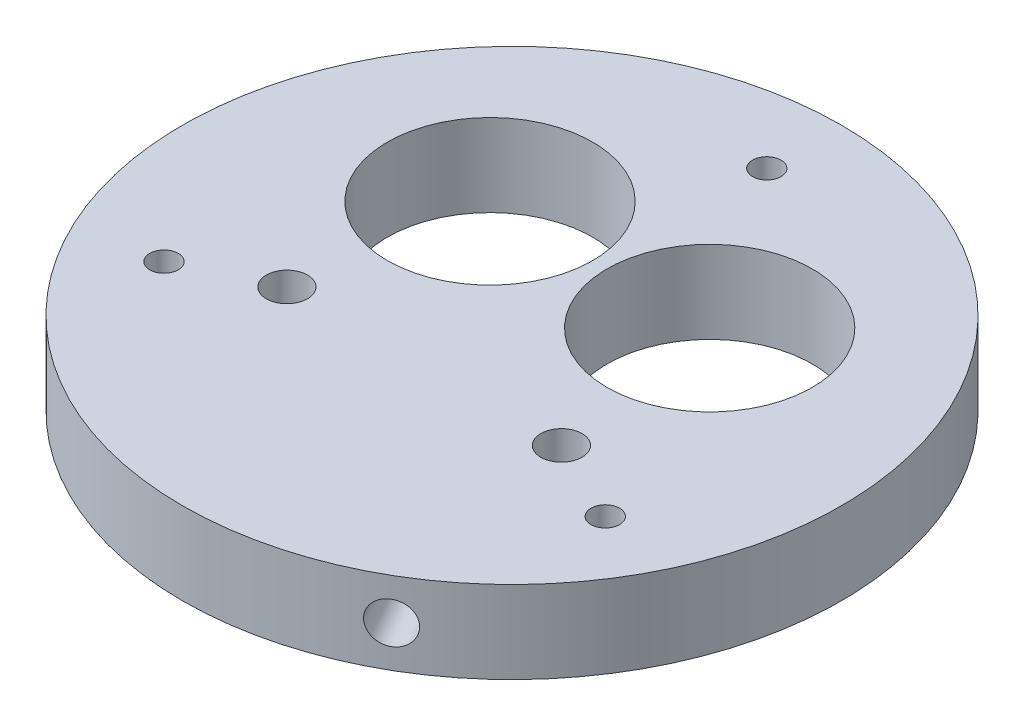
ISO-10303-21;
HEADER;
FILE_DESCRIPTION(('STEP AP214'),'2;1');
FILE_NAME('part.step','',(''),(''),'','','');
FILE_SCHEMA(('AUTOMOTIVE_DESIGN { 1 0 10303 214 1 1 1 1 }'));
ENDSEC;
DATA;
#1=APPLICATION_CONTEXT('core data for automotive mechanical design processes');
#2=APPLICATION_PROTOCOL_DEFINITION('international standard','automotive_design',2000,#1);
#3=PRODUCT_CONTEXT('',#1,'mechanical');
#4=PRODUCT('Part','Part','',(#3));
#5=PRODUCT_RELATED_PRODUCT_CATEGORY('part','',(#4));
#6=PRODUCT_DEFINITION_FORMATION('','',#4);
#7=PRODUCT_DEFINITION_CONTEXT('part definition',#1,'design');
#8=PRODUCT_DEFINITION('design','',#6,#7);
#9=PRODUCT_DEFINITION_SHAPE('','',#8);
#10=(LENGTH_UNIT() NAMED_UNIT(*) SI_UNIT(.MILLI.,.METRE.));
#11=(NAMED_UNIT(*) PLANE_ANGLE_UNIT() SI_UNIT($,.RADIAN.));
#12=(NAMED_UNIT(*) SI_UNIT($,.STERADIAN.) SOLID_ANGLE_UNIT());
#13=UNCERTAINTY_MEASURE_WITH_UNIT(LENGTH_MEASURE(1.E-05),#10,'distance_accuracy_value','');
#14=(GEOMETRIC_REPRESENTATION_CONTEXT(3) GLOBAL_UNCERTAINTY_ASSIGNED_CONTEXT((#13)) GLOBAL_UNIT_ASSIGNED_CONTEXT((#10,
#11,#12)) REPRESENTATION_CONTEXT('',''));
#15=CARTESIAN_POINT('',(0.,0.,0.));
#16=DIRECTION('',(0.,0.,1.));
#17=DIRECTION('',(1.,0.,0.));
#18=AXIS2_PLACEMENT_3D('',#15,#16,#17);
#19=CARTESIAN_POINT('',(0.,9.525,0.));
#20=DIRECTION('',(0.,-1.,0.));
#21=DIRECTION('',(0.,0.,-1.));
#22=AXIS2_PLACEMENT_3D('',#19,#20,#21);
#23=CYLINDRICAL_SURFACE('',#22,38.1127);
#24=CARTESIAN_POINT('',(21.0760412223567,4.7625,31.754974219538));
#25=CARTESIAN_POINT('',(21.0760366394158,4.62923983544651,31.7549780096859));
#26=CARTESIAN_POINT('',(21.0666489484644,4.49588634195096,31.7612141519004));
#27=CARTESIAN_POINT('',(21.0293051910214,4.23286151976421,31.7859514054377));
#28=CARTESIAN_POINT('',(21.0013275072642,4.10319466132266,31.8044667955651));
#29=CARTESIAN_POINT('',(20.9275236315503,3.8513911345155,31.8530782980891));
#30=CARTESIAN_POINT('',(20.8817068555677,3.72925053290825,31.8831683009792));
#31=CARTESIAN_POINT('',(20.7734079149441,3.49592055513315,31.9538352207014));
#32=CARTESIAN_POINT('',(20.71092956829,3.38472867805543,31.9944097349493));
#33=CARTESIAN_POINT('',(20.5708143365884,3.17625429793563,32.0846759739591));
#34=CARTESIAN_POINT('',(20.4931575769798,3.07899032452426,32.1343796472094));
#35=CARTESIAN_POINT('',(20.3247516945946,2.90129127689857,32.2411583146005));
#36=CARTESIAN_POINT('',(20.2340020261933,2.82085690437186,32.2982336159309));
#37=CARTESIAN_POINT('',(20.0417272733482,2.67904384677509,32.4178944707138));
#38=CARTESIAN_POINT('',(19.9401936531311,2.61768040994677,32.4804843823414));
#39=CARTESIAN_POINT('',(19.7291442714973,2.51584875804748,32.6091095154967));
#40=CARTESIAN_POINT('',(19.6196285951165,2.47538032041119,32.6751447003185));
#41=CARTESIAN_POINT('',(19.3957739636609,2.41653860293246,32.8085171428429));
#42=CARTESIAN_POINT('',(19.2814415211572,2.3981364214773,32.8758525797357));
#43=CARTESIAN_POINT('',(19.0510246293537,2.38386033661758,33.0099094935687));
#44=CARTESIAN_POINT('',(18.9349401997172,2.3879861805584,33.0766309773861));
#45=CARTESIAN_POINT('',(18.7044957288376,2.41862518184881,33.2074882983395));
#46=CARTESIAN_POINT('',(18.5901335171868,2.44510724809921,33.2716275968358));
#47=CARTESIAN_POINT('',(18.3662781855052,2.51965871909632,33.3957200271951));
#48=CARTESIAN_POINT('',(18.2567850941236,2.56772825084278,33.4556731344283));
#49=CARTESIAN_POINT('',(18.0458070050237,2.68412534410554,33.5699444462652));
#50=CARTESIAN_POINT('',(17.9443276399407,2.75246699667637,33.6242586957566));
#51=CARTESIAN_POINT('',(17.7524782531567,2.90745810824412,33.7259428941386));
#52=CARTESIAN_POINT('',(17.6621083557148,2.99410777198625,33.7733127653577));
#53=CARTESIAN_POINT('',(17.4950569531984,3.1834308388446,33.8601503479534));
#54=CARTESIAN_POINT('',(17.418398975997,3.28613122789602,33.8996044908121));
#55=CARTESIAN_POINT('',(17.2813078250731,3.50454590614921,33.9696960293586));
#56=CARTESIAN_POINT('',(17.2208746577659,3.62026020049682,34.0003334215601));
#57=CARTESIAN_POINT('',(17.118105997625,3.86143523082251,34.0521905045266));
#58=CARTESIAN_POINT('',(17.0757715187726,3.98689651241167,34.0734096676365));
#59=CARTESIAN_POINT('',(17.0105368371064,4.24399622181942,34.1060240925116));
#60=CARTESIAN_POINT('',(16.9876364070475,4.37563457738962,34.1174194691477));
#61=CARTESIAN_POINT('',(16.9620172373928,4.64111479483817,34.1301638035834));
#62=CARTESIAN_POINT('',(16.959264636518,4.77495258056907,34.1315296174955));
#63=CARTESIAN_POINT('',(16.9739389552718,5.04124074229214,34.1242342357314));
#64=CARTESIAN_POINT('',(16.9913657705372,5.17369112545607,34.1155730919124));
#65=CARTESIAN_POINT('',(17.0458248969068,5.4333379502686,34.0883949498703));
#66=CARTESIAN_POINT('',(17.0828416489487,5.56053847524434,34.0698857732615));
#67=CARTESIAN_POINT('',(17.1753097046026,5.80620085402902,34.0233640465242));
#68=CARTESIAN_POINT('',(17.2307611743943,5.9246626290508,33.9953514107267));
#69=CARTESIAN_POINT('',(17.3584648799842,6.14965822912002,33.9303215419672));
#70=CARTESIAN_POINT('',(17.4307394223592,6.2561759365946,33.893292350458));
#71=CARTESIAN_POINT('',(17.5898328601481,6.45409739440115,33.8109994055244));
#72=CARTESIAN_POINT('',(17.6766518971578,6.54550099757473,33.7657355719324));
#73=CARTESIAN_POINT('',(17.8623365203939,6.71072714043947,33.6678755384031));
#74=CARTESIAN_POINT('',(17.9612185613172,6.78452525054199,33.6152693085664));
#75=CARTESIAN_POINT('',(18.1679714369437,6.91227837888538,33.5039770760276));
#76=CARTESIAN_POINT('',(18.2758422164694,6.96623351892175,33.4452911106457));
#77=CARTESIAN_POINT('',(18.4973004702813,7.05272662376929,33.3233211418744));
#78=CARTESIAN_POINT('',(18.6108837528295,7.08528005291724,33.2600404952821));
#79=CARTESIAN_POINT('',(18.8405245180975,7.12809627337091,33.1304981656239));
#80=CARTESIAN_POINT('',(18.9565819766364,7.13835928242649,33.0642365116852));
#81=CARTESIAN_POINT('',(19.1876400791901,7.13630121823691,32.9306869973518));
#82=CARTESIAN_POINT('',(19.3026421805898,7.12401837921867,32.8634010658438));
#83=CARTESIAN_POINT('',(19.5285556890179,7.07729655177778,32.7296601309944));
#84=CARTESIAN_POINT('',(19.6394670888444,7.04285752435006,32.6632051291161));
#85=CARTESIAN_POINT('',(19.8541439104272,6.95280952372205,32.533162065675));
#86=CARTESIAN_POINT('',(19.9579093809251,6.89720069493608,32.4695739845583));
#87=CARTESIAN_POINT('',(20.1554972974021,6.76639697704172,32.3472927233238));
#88=CARTESIAN_POINT('',(20.2493200019863,6.69120259751732,32.2885994159045));
#89=CARTESIAN_POINT('',(20.4246877885775,6.5232211222031,32.177955443998));
#90=CARTESIAN_POINT('',(20.5062132374304,6.43040641723475,32.1260155795692));
#91=CARTESIAN_POINT('',(20.6547021706383,6.22985544097584,32.0307506103098));
#92=CARTESIAN_POINT('',(20.7216620859795,6.12211552310079,31.987427617106));
#93=CARTESIAN_POINT('',(20.8393385178461,5.89464993528759,31.9108887458249));
#94=CARTESIAN_POINT('',(20.8900348472884,5.77490960987748,31.8776854312735));
#95=CARTESIAN_POINT('',(20.9737224291797,5.52703554963833,31.8226868749198));
#96=CARTESIAN_POINT('',(21.0067344217382,5.39891184565561,31.8008782701975));
#97=CARTESIAN_POINT('',(21.0456383722794,5.18542007143344,31.7751367123279));
#98=CARTESIAN_POINT('',(21.0570260462234,5.10143206263123,31.7675878827828));
#99=CARTESIAN_POINT('',(21.0722289277564,4.93247536067763,31.757505430987));
#100=CARTESIAN_POINT('',(21.076044145815,4.84750666888227,31.7549718018024));
#101=CARTESIAN_POINT('',(21.0760412223567,4.7625,31.754974219538));
#102=B_SPLINE_CURVE_WITH_KNOTS('',3,(#24,#25,#26,#27,#28,#29,#30,#31,#32,#33,#34,#35,#36,#37,
#38,#39,#40,#41,#42,#43,#44,#45,#46,#47,#48,#49,#50,#51,#52,#53,#54,#55,#56,#57,#58,#59,#60,#61,
#62,#63,#64,#65,#66,#67,#68,#69,#70,#71,#72,#73,#74,#75,#76,#77,#78,#79,#80,#81,#82,#83,#84,#85,
#86,#87,#88,#89,#90,#91,#92,#93,#94,#95,#96,#97,#98,#99,#100,#101),.UNSPECIFIED.,.T.,.F.,(4,2,2,
2,2,2,2,2,2,2,2,2,2,2,2,2,2,2,2,2,2,2,2,2,2,2,2,2,2,2,2,2,2,2,2,2,2,2,4),(0.,0.399470166575744,
0.799405669569558,1.19913036091437,1.59876353422035,1.99892353439711,2.39910021538456,
2.79959604090947,3.20008760042221,3.60005403509276,4.0000159840989,4.3994226152202,
4.79883159609414,5.19851885742417,5.59821058884018,5.99858169444916,6.39895295837009,
6.7993466502068,7.19973566011932,7.59945160478513,7.99916548222124,8.3985623673094,
8.79796285285544,9.19789597157583,9.59783298401314,9.99832176716476,10.3988080920882,
10.7990047167025,11.1991974318728,11.5987121097933,11.9982274910451,12.3977401469663,
12.7972424092598,13.1973758943832,13.597607314624,13.9983336147515,14.3985889102477,
14.653411311538,14.9082333605144),.UNSPECIFIED.);
#103=CARTESIAN_POINT('',(21.0760412223567,4.7625,31.754974219538));
#104=VERTEX_POINT('',#103);
#105=EDGE_CURVE('E91',#104,#104,#102,.T.);
#106=ORIENTED_EDGE('',*,*,#105,.T.);
#107=EDGE_LOOP('',(#106));
#108=FACE_BOUND('',#107,.T.);
#109=CARTESIAN_POINT('',(-38.0386349818182,4.7625,2.37489999999974));
#110=CARTESIAN_POINT('',(-38.0386359727121,4.62923983544651,2.37489413598259));
#111=CARTESIAN_POINT('',(-38.0393427848158,4.49588634195096,2.36364608602858));
#112=CARTESIAN_POINT('',(-38.0420939960774,4.23286151976421,2.31893681664145));
#113=CARTESIAN_POINT('',(-38.0441399524101,4.10319466132266,2.28544973670502));
#114=CARTESIAN_POINT('',(-38.0493368106551,3.8513911345155,2.19722795417699));
#115=CARTESIAN_POINT('',(-38.0524871295666,3.72925053290825,2.14250446081157));
#116=CARTESIAN_POINT('',(-38.0595370069414,3.49592055513315,2.01338136716741));
#117=CARTESIAN_POINT('',(-38.0634363936992,3.38472867805543,1.93898627465461));
#118=CARTESIAN_POINT('',(-38.071551633935,3.17625429793563,1.772509805039));
#119=CARTESIAN_POINT('',(-38.0757678978269,3.07899032452426,1.68040524181714));
#120=CARTESIAN_POINT('',(-38.0840379951772,2.90129127689857,1.48117213582934));
#121=CARTESIAN_POINT('',(-38.0880918218573,2.82085690437186,1.37404296694357));
#122=CARTESIAN_POINT('',(-38.0955837855154,2.67904384677508,1.14769771908191));
#123=CARTESIAN_POINT('',(-38.0990214288969,2.61768040994676,1.02847206882181));
#124=CARTESIAN_POINT('',(-38.1048893709577,2.51584875804748,0.781385376296295));
#125=CARTESIAN_POINT('',(-38.1073196803666,2.47538032041119,0.6535244260271));
#126=CARTESIAN_POINT('',(-38.1108962880296,2.41653860293246,0.392974407169469));
#127=CARTESIAN_POINT('',(-38.1120442657019,2.3981364214773,0.260291889038118));
#128=CARTESIAN_POINT('',(-38.1129325127325,2.38386033661758,-0.00628344964126589));
#129=CARTESIAN_POINT('',(-38.1126727978782,2.3879861805584,-0.140176256598945));
#130=CARTESIAN_POINT('',(-38.1107763266553,2.41862518184881,-0.405175683018997));
#131=CARTESIAN_POINT('',(-38.1091414827086,2.44510724809921,-0.536285912789689));
#132=CARTESIAN_POINT('',(-38.1046810139763,2.51965871909632,-0.792196531978296));
#133=CARTESIAN_POINT('',(-38.1018553821853,2.56772825084278,-0.916996884270195));
#134=CARTESIAN_POINT('',(-38.0953281966098,2.68412534410554,-1.15684492499112));
#135=CARTESIAN_POINT('',(-38.0916260339154,2.75246699667637,-1.2718857578586));
#136=CARTESIAN_POINT('',(-38.0837624394857,2.90745810824412,-1.48887429970503));
#137=CARTESIAN_POINT('',(-38.0796010026144,2.99410777198625,-1.59082186223663));
#138=CARTESIAN_POINT('',(-38.0712788538873,3.1834308388446,-1.77891141185151));
#139=CARTESIAN_POINT('',(-38.0671181552869,3.28613122789602,-1.86502623893997));
#140=CARTESIAN_POINT('',(-38.0592736327965,3.50454590614921,-2.01879642754742));
#141=CARTESIAN_POINT('',(-38.0555898090951,3.62026020049682,-2.08645178176728));
#142=CARTESIAN_POINT('',(-38.0491150302397,3.86143523082251,-2.20138059364549));
#143=CARTESIAN_POINT('',(-38.0463241251138,3.98689651241167,-2.24865290934261));
#144=CARTESIAN_POINT('',(-38.0419517047523,4.24399622181942,-2.32145501331087));
#145=CARTESIAN_POINT('',(-38.0403701753754,4.37563457738962,-2.34698505581749));
#146=CARTESIAN_POINT('',(-38.0385975079237,4.64111479483817,-2.3755440747802));
#147=CARTESIAN_POINT('',(-38.038404037031,4.77495258056907,-2.37861080402032));
#148=CARTESIAN_POINT('',(-38.03942321047,5.04124074229214,-2.3622547803142));
#149=CARTESIAN_POINT('',(-38.0406358475295,5.17369112545607,-2.34283214367779));
#150=CARTESIAN_POINT('',(-38.0443284492782,5.4333379502686,-2.28208008575283));
#151=CARTESIAN_POINT('',(-38.0468074081529,5.56053847524434,-2.24076804981454));
#152=CARTESIAN_POINT('',(-38.0527524387974,5.80620085402902,-2.137427501211));
#153=CARTESIAN_POINT('',(-38.0562185194656,5.9246626290508,-2.07539880179551));
#154=CARTESIAN_POINT('',(-38.06375285391,6.14965822912002,-1.93228921421749));
#155=CARTESIAN_POINT('',(-38.067821904569,6.25617593659461,-1.85118302871922));
#156=CARTESIAN_POINT('',(-38.0761008425987,6.45409739440115,-1.6722575975518));
#157=CARTESIAN_POINT('',(-38.0803107313402,6.54550099757473,-1.57443818917331));
#158=CARTESIAN_POINT('',(-38.0884037679067,6.71072714043947,-1.36470057159411));
#159=CARTESIAN_POINT('',(-38.0922864569324,6.78452525054199,-1.25276309725812));
#160=CARTESIAN_POINT('',(-38.0992809941233,6.91227837888538,-1.01806373839066));
#161=CARTESIAN_POINT('',(-38.1023928470198,6.96623351892175,-0.895301920304402));
#162=CARTESIAN_POINT('',(-38.107492882471,7.05272662376929,-0.642528462239899));
#163=CARTESIAN_POINT('',(-38.1094818762282,7.08528005291724,-0.51252213081175));
#164=CARTESIAN_POINT('',(-38.1121153105128,7.12809627337091,-0.248876229516099));
#165=CARTESIAN_POINT('',(-38.1127597641746,7.13835928242649,-0.115236695153412));
#166=CARTESIAN_POINT('',(-38.1126315433756,7.13630121823691,0.15164024857506));
#167=CARTESIAN_POINT('',(-38.1118612680722,7.12401837921867,0.284877955629739));
#168=CARTESIAN_POINT('',(-38.1089949751808,7.07729655177778,0.547395260411217));
#169=CARTESIAN_POINT('',(-38.1068989552589,7.04285752435006,0.676674851169493));
#170=CARTESIAN_POINT('',(-38.1016167695243,6.95280952372205,0.92761196398437));
#171=CARTESIAN_POINT('',(-38.0984306111483,6.89720069493608,1.04926953802959));
#172=CARTESIAN_POINT('',(-38.091325890751,6.76639697704172,1.28152632379673));
#173=CARTESIAN_POINT('',(-38.0874073477859,6.69120259751732,1.39212582312806));
#174=CARTESIAN_POINT('',(-38.0792707506348,6.5232211222031,1.59932076727469));
#175=CARTESIAN_POINT('',(-38.0750522329968,6.43040641723475,1.69589380925072));
#176=CARTESIAN_POINT('',(-38.0667948161314,6.22985544097584,1.87212148221924));
#177=CARTESIAN_POINT('',(-38.0627559611195,6.12211552310079,1.95177196654192));
#178=CARTESIAN_POINT('',(-38.0553095701463,5.89464993528759,2.09195218160562));
#179=CARTESIAN_POINT('',(-38.0519028209761,5.77490960987748,2.152458148057));
#180=CARTESIAN_POINT('',(-38.046116464948,5.52703554963833,2.252432998133));
#181=CARTESIAN_POINT('',(-38.0437356555167,5.39891184565561,2.29192652467931));
#182=CARTESIAN_POINT('',(-38.0408947877392,5.18542007143344,2.33848911309042));
#183=CARTESIAN_POINT('',(-38.0400511465564,5.10143206263123,2.35212554278849));
#184=CARTESIAN_POINT('',(-38.0389209279353,4.93247536067763,2.37033285030469));
#185=CARTESIAN_POINT('',(-38.0386343497268,4.84750666888227,2.37490374065671));
#186=CARTESIAN_POINT('',(-38.0386349818182,4.7625,2.37489999999974));
#187=B_SPLINE_CURVE_WITH_KNOTS('',3,(#109,#110,#111,#112,#113,#114,#115,#116,#117,#118,#119,
#120,#121,#122,#123,#124,#125,#126,#127,#128,#129,#130,#131,#132,#133,#134,#135,#136,#137,#138,
#139,#140,#141,#142,#143,#144,#145,#146,#147,#148,#149,#150,#151,#152,#153,#154,#155,#156,#157,
#158,#159,#160,#161,#162,#163,#164,#165,#166,#167,#168,#169,#170,#171,#172,#173,#174,#175,#176,
#177,#178,#179,#180,#181,#182,#183,#184,#185,#186),.UNSPECIFIED.,.T.,.F.,(4,2,2,2,2,2,2,2,2,2,2,
2,2,2,2,2,2,2,2,2,2,2,2,2,2,2,2,2,2,2,2,2,2,2,2,2,2,2,4),(0.,0.399470166575745,
0.799405669569559,1.19913036091437,1.59876353422035,1.99892353439712,2.39910021538456,
2.79959604090948,3.20008760042221,3.60005403509275,4.0000159840989,4.3994226152202,
4.79883159609414,5.19851885742417,5.59821058884018,5.99858169444916,6.39895295837009,
6.7993466502068,7.19973566011932,7.59945160478513,7.99916548222124,8.39856236730939,
8.79796285285544,9.19789597157583,9.59783298401314,9.99832176716475,10.3988080920882,
10.7990047167025,11.1991974318728,11.5987121097933,11.9982274910452,12.3977401469663,
12.7972424092598,13.1973758943832,13.597607314624,13.9983336147515,14.3985889102477,
14.653411311538,14.9082333605144),.UNSPECIFIED.);
#188=CARTESIAN_POINT('',(-38.0386349818182,4.7625,2.37489999999974));
#189=VERTEX_POINT('',#188);
#190=EDGE_CURVE('E92',#189,#189,#187,.T.);
#191=ORIENTED_EDGE('',*,*,#190,.T.);
#192=EDGE_LOOP('',(#191));
#193=FACE_BOUND('',#192,.T.);
#194=CARTESIAN_POINT('',(16.9625937594613,4.7625,-34.129874219538));
#195=CARTESIAN_POINT('',(16.9625993332961,4.62923983544651,-34.1298721456687));
#196=CARTESIAN_POINT('',(16.9726938363512,4.49588634195096,-34.1248602379292));
#197=CARTESIAN_POINT('',(17.0127888050559,4.23286151976421,-34.1048882220794));
#198=CARTESIAN_POINT('',(17.0428124451457,4.10319466132266,-34.0899165322703));
#199=CARTESIAN_POINT('',(17.1218131791047,3.8513911345155,-34.0503062522664));
#200=CARTESIAN_POINT('',(17.1707802739987,3.72925053290825,-34.025672761791));
#201=CARTESIAN_POINT('',(17.2861290919972,3.49592055513315,-33.9672165878691));
#202=CARTESIAN_POINT('',(17.3525068254091,3.38472867805543,-33.9333960096041));
#203=CARTESIAN_POINT('',(17.5007372973464,3.17625429793563,-33.8571857789983));
#204=CARTESIAN_POINT('',(17.582610320847,3.07899032452425,-33.8147848890268));
#205=CARTESIAN_POINT('',(17.7592863005824,2.90129127689856,-33.7223304504301));
#206=CARTESIAN_POINT('',(17.8540897956639,2.82085690437185,-33.6722765828747));
#207=CARTESIAN_POINT('',(18.053856512167,2.67904384677508,-33.565592189796));
#208=CARTESIAN_POINT('',(18.1588277757657,2.61768040994676,-33.5089564511635));
#209=CARTESIAN_POINT('',(18.3757450994603,2.51584875804748,-33.3904948917933));
#210=CARTESIAN_POINT('',(18.4876910852499,2.47538032041119,-33.3286691263459));
#211=CARTESIAN_POINT('',(18.7151223243686,2.41653860293246,-33.2014915500126));
#212=CARTESIAN_POINT('',(18.8306027445446,2.3981364214773,-33.1361444687741));
#213=CARTESIAN_POINT('',(19.0619078833787,2.38386033661758,-33.0036260439278));
#214=CARTESIAN_POINT('',(19.1777325981609,2.3879861805584,-32.9364547207874));
#215=CARTESIAN_POINT('',(19.4062805978175,2.41862518184881,-32.8023126153207));
#216=CARTESIAN_POINT('',(19.5190079655216,2.44510724809921,-32.7353416840463));
#217=CARTESIAN_POINT('',(19.738402828471,2.51965871909632,-32.6035234952171));
#218=CARTESIAN_POINT('',(19.8450702880615,2.56772825084278,-32.5386762501584));
#219=CARTESIAN_POINT('',(20.049521191586,2.68412534410554,-32.4130995212744));
#220=CARTESIAN_POINT('',(20.1472983939746,2.75246699667637,-32.3523729378983));
#221=CARTESIAN_POINT('',(20.3312841863289,2.90745810824412,-32.2370685944339));
#222=CARTESIAN_POINT('',(20.4174926468995,2.99410777198625,-32.1824909031213));
#223=CARTESIAN_POINT('',(20.5762219006888,3.1834308388446,-32.0812389361022));
#224=CARTESIAN_POINT('',(20.6487191792897,3.28613122789603,-32.0345782518724));
#225=CARTESIAN_POINT('',(20.7779658077233,3.50454590614921,-31.9508996018115));
#226=CARTESIAN_POINT('',(20.834715151329,3.62026020049682,-31.9138816397931));
#227=CARTESIAN_POINT('',(20.9310090326146,3.86143523082251,-31.8508099108814));
#228=CARTESIAN_POINT('',(20.9705526063411,3.98689651241167,-31.8247567582942));
#229=CARTESIAN_POINT('',(21.0314148676458,4.24399622181942,-31.784569079201));
#230=CARTESIAN_POINT('',(21.0527337683278,4.37563457738962,-31.7704344133304));
#231=CARTESIAN_POINT('',(21.0765802705308,4.64111479483817,-31.7546197288035));
#232=CARTESIAN_POINT('',(21.079139400513,4.77495258056907,-31.7529188134755));
#233=CARTESIAN_POINT('',(21.065484255198,5.04124074229214,-31.7619794554175));
#234=CARTESIAN_POINT('',(21.0492700769922,5.17369112545607,-31.7727409482349));
#235=CARTESIAN_POINT('',(20.9985035523713,5.4333379502686,-31.8063148641178));
#236=CARTESIAN_POINT('',(20.963965759204,5.56053847524434,-31.8291177234473));
#237=CARTESIAN_POINT('',(20.8774427341946,5.80620085402902,-31.8859365453135));
#238=CARTESIAN_POINT('',(20.8254573450712,5.9246626290508,-31.9199526089315));
#239=CARTESIAN_POINT('',(20.7052879739257,6.14965822912002,-31.99803232775));
#240=CARTESIAN_POINT('',(20.6370824822097,6.2561759365946,-32.0421093217391));
#241=CARTESIAN_POINT('',(20.4862679824505,6.45409739440115,-32.1387418079729));
#242=CARTESIAN_POINT('',(20.4036588341823,6.54550099757473,-32.1912973827593));
#243=CARTESIAN_POINT('',(20.2260672475127,6.71072714043947,-32.3031749668093));
#244=CARTESIAN_POINT('',(20.1310678956151,6.78452525054199,-32.3625062113085));
#245=CARTESIAN_POINT('',(19.9313095571794,6.91227837888538,-32.4859133376372));
#246=CARTESIAN_POINT('',(19.8265506305502,6.96623351892175,-32.5499891903416));
#247=CARTESIAN_POINT('',(19.6101924121895,7.05272662376929,-32.6807926796348));
#248=CARTESIAN_POINT('',(19.4985981233985,7.08528005291724,-32.7475183644706));
#249=CARTESIAN_POINT('',(19.2715907924151,7.12809627337091,-32.881621936108));
#250=CARTESIAN_POINT('',(19.156177787538,7.13835928242649,-32.9489998165321));
#251=CARTESIAN_POINT('',(18.9249914641853,7.13630121823691,-33.0823272459271));
#252=CARTESIAN_POINT('',(18.8092190874823,7.12401837921867,-33.1482790214738));
#253=CARTESIAN_POINT('',(18.5804392861628,7.07729655177778,-33.2770553914059));
#254=CARTESIAN_POINT('',(18.4674318664143,7.04285752435006,-33.3398799802858));
#255=CARTESIAN_POINT('',(18.247472859097,6.95280952372205,-33.4607740296596));
#256=CARTESIAN_POINT('',(18.1405212302231,6.89720069493608,-33.5188435225881));
#257=CARTESIAN_POINT('',(17.9358285933487,6.76639697704173,-33.6288190471208));
#258=CARTESIAN_POINT('',(17.8380873457994,6.69120259751732,-33.6807252390329));
#259=CARTESIAN_POINT('',(17.6545829620572,6.5232211222031,-33.777276211273));
#260=CARTESIAN_POINT('',(17.5688389955662,6.43040641723475,-33.8219093888201));
#261=CARTESIAN_POINT('',(17.4120926454929,6.22985544097584,-33.9028720925293));
#262=CARTESIAN_POINT('',(17.3410938751398,6.12211552310079,-33.9391995836482));
#263=CARTESIAN_POINT('',(17.2159710523001,5.89464993528759,-34.0028409274307));
#264=CARTESIAN_POINT('',(17.1618679736876,5.77490960987748,-34.0301435793307));
#265=CARTESIAN_POINT('',(17.0723940357682,5.52703554963833,-34.075119873053));
#266=CARTESIAN_POINT('',(17.0370012337784,5.39891184565561,-34.0928047948771));
#267=CARTESIAN_POINT('',(16.9952564154596,5.18542007143344,-34.1136258254185));
#268=CARTESIAN_POINT('',(16.9830251003328,5.10143206263123,-34.1197134255716));
#269=CARTESIAN_POINT('',(16.9666920001787,4.93247536067763,-34.127838281292));
#270=CARTESIAN_POINT('',(16.9625902039117,4.84750666888227,-34.1298755424593));
#271=CARTESIAN_POINT('',(16.9625937594613,4.7625,-34.129874219538));
#272=B_SPLINE_CURVE_WITH_KNOTS('',3,(#194,#195,#196,#197,#198,#199,#200,#201,#202,#203,#204,
#205,#206,#207,#208,#209,#210,#211,#212,#213,#214,#215,#216,#217,#218,#219,#220,#221,#222,#223,
#224,#225,#226,#227,#228,#229,#230,#231,#232,#233,#234,#235,#236,#237,#238,#239,#240,#241,#242,
#243,#244,#245,#246,#247,#248,#249,#250,#251,#252,#253,#254,#255,#256,#257,#258,#259,#260,#261,
#262,#263,#264,#265,#266,#267,#268,#269,#270,#271),.UNSPECIFIED.,.T.,.F.,(4,2,2,2,2,2,2,2,2,2,2,
2,2,2,2,2,2,2,2,2,2,2,2,2,2,2,2,2,2,2,2,2,2,2,2,2,2,2,4),(0.,0.399470166575744,0.79940566956956,
1.19913036091437,1.59876353422035,1.99892353439712,2.39910021538456,2.79959604090948,
3.20008760042221,3.60005403509275,4.0000159840989,4.39942261522021,4.79883159609414,
5.19851885742417,5.59821058884018,5.99858169444916,6.39895295837009,6.7993466502068,
7.19973566011932,7.59945160478513,7.99916548222124,8.39856236730939,8.79796285285544,
9.19789597157583,9.59783298401314,9.99832176716475,10.3988080920882,10.7990047167025,
11.1991974318728,11.5987121097933,11.9982274910451,12.3977401469663,12.7972424092598,
13.1973758943832,13.597607314624,13.9983336147515,14.3985889102477,14.653411311538,
14.9082333605144),.UNSPECIFIED.);
#273=CARTESIAN_POINT('',(16.9625937594613,4.7625,-34.129874219538));
#274=VERTEX_POINT('',#273);
#275=EDGE_CURVE('E10',#274,#274,#272,.T.);
#276=ORIENTED_EDGE('',*,*,#275,.T.);
#277=EDGE_LOOP('',(#276));
#278=FACE_BOUND('',#277,.T.);
#279=CARTESIAN_POINT('',(0.,9.525,0.));
#280=DIRECTION('',(0.,1.,0.));
#281=DIRECTION('',(0.,0.,1.));
#282=AXIS2_PLACEMENT_3D('',#279,#280,#281);
#283=CIRCLE('',#282,38.1127);
#284=CARTESIAN_POINT('',(0.,9.525,38.1127));
#285=VERTEX_POINT('',#284);
#286=EDGE_CURVE('E44',#285,#285,#283,.T.);
#287=ORIENTED_EDGE('',*,*,#286,.F.);
#288=EDGE_LOOP('',(#287));
#289=FACE_BOUND('',#288,.T.);
#290=CARTESIAN_POINT('',(0.,0.,0.));
#291=DIRECTION('',(0.,1.,0.));
#292=DIRECTION('',(0.,0.,1.));
#293=AXIS2_PLACEMENT_3D('',#290,#291,#292);
#294=CIRCLE('',#293,38.1127);
#295=CARTESIAN_POINT('',(0.,0.,38.1127));
#296=VERTEX_POINT('',#295);
#297=EDGE_CURVE('E48',#296,#296,#294,.T.);
#298=ORIENTED_EDGE('',*,*,#297,.T.);
#299=EDGE_LOOP('',(#298));
#300=FACE_BOUND('',#299,.T.);
#301=ADVANCED_FACE('F33',(#108,#193,#278,#289,#300),#23,.T.);
#302=CARTESIAN_POINT('',(0.,9.525,0.));
#303=DIRECTION('',(0.,1.,0.));
#304=DIRECTION('',(0.,0.,1.));
#305=AXIS2_PLACEMENT_3D('',#302,#303,#304);
#306=PLANE('',#305);
#307=CARTESIAN_POINT('',(-15.875,9.525,10.16));
#308=DIRECTION('',(0.,1.,0.));
#309=DIRECTION('',(0.,0.,1.));
#310=AXIS2_PLACEMENT_3D('',#307,#308,#309);
#311=CIRCLE('',#310,2.38125);
#312=CARTESIAN_POINT('',(-15.875,9.525,12.54125));
#313=VERTEX_POINT('',#312);
#314=EDGE_CURVE('E130',#313,#313,#311,.T.);
#315=ORIENTED_EDGE('',*,*,#314,.F.);
#316=EDGE_LOOP('',(#315));
#317=FACE_BOUND('',#316,.T.);
#318=CARTESIAN_POINT('',(15.875,9.525,10.16));
#319=DIRECTION('',(0.,1.,0.));
#320=DIRECTION('',(0.,0.,1.));
#321=AXIS2_PLACEMENT_3D('',#318,#319,#320);
#322=CIRCLE('',#321,2.38125);
#323=CARTESIAN_POINT('',(15.875,9.525,12.54125));
#324=VERTEX_POINT('',#323);
#325=EDGE_CURVE('E124',#324,#324,#322,.T.);
#326=ORIENTED_EDGE('',*,*,#325,.F.);
#327=EDGE_LOOP('',(#326));
#328=FACE_BOUND('',#327,.T.);
#329=CARTESIAN_POINT('',(0.,9.525,-29.464));
#330=DIRECTION('',(0.,1.,0.));
#331=DIRECTION('',(0.,0.,1.));
#332=AXIS2_PLACEMENT_3D('',#329,#330,#331);
#333=CIRCLE('',#332,1.651);
#334=CARTESIAN_POINT('',(0.,9.525,-27.813));
#335=VERTEX_POINT('',#334);
#336=EDGE_CURVE('E80',#335,#335,#333,.T.);
#337=ORIENTED_EDGE('',*,*,#336,.F.);
#338=EDGE_LOOP('',(#337));
#339=FACE_BOUND('',#338,.T.);
#340=CARTESIAN_POINT('',(-25.5165724971028,9.525,14.7320000000011));
#341=DIRECTION('',(0.,1.,0.));
#342=DIRECTION('',(0.,0.,1.));
#343=AXIS2_PLACEMENT_3D('',#340,#341,#342);
#344=CIRCLE('',#343,1.651);
#345=CARTESIAN_POINT('',(-25.5165724971028,9.525,16.3830000000011));
#346=VERTEX_POINT('',#345);
#347=EDGE_CURVE('E74',#346,#346,#344,.T.);
#348=ORIENTED_EDGE('',*,*,#347,.F.);
#349=EDGE_LOOP('',(#348));
#350=FACE_BOUND('',#349,.T.);
#351=CARTESIAN_POINT('',(-12.7,9.525,-10.16));
#352=DIRECTION('',(0.,1.,0.));
#353=DIRECTION('',(0.,0.,1.));
#354=AXIS2_PLACEMENT_3D('',#351,#352,#353);
#355=CIRCLE('',#354,11.8745);
#356=CARTESIAN_POINT('',(-12.7,9.525,1.7145));
#357=VERTEX_POINT('',#356);
#358=EDGE_CURVE('E68',#357,#357,#355,.T.);
#359=ORIENTED_EDGE('',*,*,#358,.F.);
#360=EDGE_LOOP('',(#359));
#361=FACE_BOUND('',#360,.T.);
#362=CARTESIAN_POINT('',(12.7,9.525,-10.16));
#363=DIRECTION('',(0.,1.,0.));
#364=DIRECTION('',(0.,0.,1.));
#365=AXIS2_PLACEMENT_3D('',#362,#363,#364);
#366=CIRCLE('',#365,11.8745);
#367=CARTESIAN_POINT('',(12.7,9.525,1.7145));
#368=VERTEX_POINT('',#367);
#369=EDGE_CURVE('E62',#368,#368,#366,.T.);
#370=ORIENTED_EDGE('',*,*,#369,.F.);
#371=EDGE_LOOP('',(#370));
#372=FACE_BOUND('',#371,.T.);
#373=CARTESIAN_POINT('',(25.5165724971066,9.525,14.7319999999989));
#374=DIRECTION('',(0.,1.,0.));
#375=DIRECTION('',(0.,0.,1.));
#376=AXIS2_PLACEMENT_3D('',#373,#374,#375);
#377=CIRCLE('',#376,1.651);
#378=CARTESIAN_POINT('',(25.5165724971066,9.525,16.3829999999989));
#379=VERTEX_POINT('',#378);
#380=EDGE_CURVE('E55',#379,#379,#377,.T.);
#381=ORIENTED_EDGE('',*,*,#380,.F.);
#382=EDGE_LOOP('',(#381));
#383=FACE_BOUND('',#382,.T.);
#384=ORIENTED_EDGE('',*,*,#286,.T.);
#385=EDGE_LOOP('',(#384));
#386=FACE_BOUND('',#385,.T.);
#387=ADVANCED_FACE('F146',(#317,#328,#339,#350,#361,#372,#383,#386),#306,.T.);
#388=CARTESIAN_POINT('',(0.,0.,0.));
#389=DIRECTION('',(0.,1.,0.));
#390=DIRECTION('',(0.,0.,1.));
#391=AXIS2_PLACEMENT_3D('',#388,#389,#390);
#392=PLANE('',#391);
#393=CARTESIAN_POINT('',(-15.875,0.,10.16));
#394=DIRECTION('',(0.,1.,0.));
#395=DIRECTION('',(0.,0.,1.));
#396=AXIS2_PLACEMENT_3D('',#393,#394,#395);
#397=CIRCLE('',#396,2.38125);
#398=CARTESIAN_POINT('',(-15.875,0.,12.54125));
#399=VERTEX_POINT('',#398);
#400=EDGE_CURVE('E100',#399,#399,#397,.T.);
#401=ORIENTED_EDGE('',*,*,#400,.T.);
#402=EDGE_LOOP('',(#401));
#403=FACE_BOUND('',#402,.T.);
#404=CARTESIAN_POINT('',(15.875,0.,10.16));
#405=DIRECTION('',(0.,1.,0.));
#406=DIRECTION('',(0.,0.,1.));
#407=AXIS2_PLACEMENT_3D('',#404,#405,#406);
#408=CIRCLE('',#407,2.38125);
#409=CARTESIAN_POINT('',(15.875,0.,12.54125));
#410=VERTEX_POINT('',#409);
#411=EDGE_CURVE('E127',#410,#410,#408,.T.);
#412=ORIENTED_EDGE('',*,*,#411,.T.);
#413=EDGE_LOOP('',(#412));
#414=FACE_BOUND('',#413,.T.);
#415=CARTESIAN_POINT('',(0.,0.,-29.464));
#416=DIRECTION('',(0.,1.,0.));
#417=DIRECTION('',(0.,0.,1.));
#418=AXIS2_PLACEMENT_3D('',#415,#416,#417);
#419=CIRCLE('',#418,1.651);
#420=CARTESIAN_POINT('',(0.,0.,-27.813));
#421=VERTEX_POINT('',#420);
#422=EDGE_CURVE('E53',#421,#421,#419,.T.);
#423=ORIENTED_EDGE('',*,*,#422,.T.);
#424=EDGE_LOOP('',(#423));
#425=FACE_BOUND('',#424,.T.);
#426=CARTESIAN_POINT('',(-25.5165724971028,0.,14.7320000000011));
#427=DIRECTION('',(0.,1.,0.));
#428=DIRECTION('',(0.,0.,1.));
#429=AXIS2_PLACEMENT_3D('',#426,#427,#428);
#430=CIRCLE('',#429,1.651);
#431=CARTESIAN_POINT('',(-25.5165724971028,0.,16.3830000000011));
#432=VERTEX_POINT('',#431);
#433=EDGE_CURVE('E77',#432,#432,#430,.T.);
#434=ORIENTED_EDGE('',*,*,#433,.T.);
#435=EDGE_LOOP('',(#434));
#436=FACE_BOUND('',#435,.T.);
#437=CARTESIAN_POINT('',(-12.7,0.,-10.16));
#438=DIRECTION('',(0.,1.,0.));
#439=DIRECTION('',(0.,0.,1.));
#440=AXIS2_PLACEMENT_3D('',#437,#438,#439);
#441=CIRCLE('',#440,11.8745);
#442=CARTESIAN_POINT('',(-12.7,0.,1.7145));
#443=VERTEX_POINT('',#442);
#444=EDGE_CURVE('E71',#443,#443,#441,.T.);
#445=ORIENTED_EDGE('',*,*,#444,.T.);
#446=EDGE_LOOP('',(#445));
#447=FACE_BOUND('',#446,.T.);
#448=CARTESIAN_POINT('',(12.7,0.,-10.16));
#449=DIRECTION('',(0.,1.,0.));
#450=DIRECTION('',(0.,0.,1.));
#451=AXIS2_PLACEMENT_3D('',#448,#449,#450);
#452=CIRCLE('',#451,11.8745);
#453=CARTESIAN_POINT('',(12.7,0.,1.7145));
#454=VERTEX_POINT('',#453);
#455=EDGE_CURVE('E65',#454,#454,#452,.T.);
#456=ORIENTED_EDGE('',*,*,#455,.T.);
#457=EDGE_LOOP('',(#456));
#458=FACE_BOUND('',#457,.T.);
#459=CARTESIAN_POINT('',(25.5165724971066,0.,14.7319999999989));
#460=DIRECTION('',(0.,1.,0.));
#461=DIRECTION('',(0.,0.,1.));
#462=AXIS2_PLACEMENT_3D('',#459,#460,#461);
#463=CIRCLE('',#462,1.651);
#464=CARTESIAN_POINT('',(25.5165724971066,0.,16.3829999999989));
#465=VERTEX_POINT('',#464);
#466=EDGE_CURVE('E58',#465,#465,#463,.T.);
#467=ORIENTED_EDGE('',*,*,#466,.T.);
#468=EDGE_LOOP('',(#467));
#469=FACE_BOUND('',#468,.T.);
#470=ORIENTED_EDGE('',*,*,#297,.F.);
#471=EDGE_LOOP('',(#470));
#472=FACE_BOUND('',#471,.T.);
#473=ADVANCED_FACE('F136',(#403,#414,#425,#436,#447,#458,#469,#472),#392,.F.);
#474=CARTESIAN_POINT('',(25.5165724971066,0.,14.7319999999989));
#475=DIRECTION('',(0.,1.,0.));
#476=DIRECTION('',(0.,0.,1.));
#477=AXIS2_PLACEMENT_3D('',#474,#475,#476);
#478=CYLINDRICAL_SURFACE('',#477,1.651);
#479=ORIENTED_EDGE('',*,*,#466,.F.);
#480=EDGE_LOOP('',(#479));
#481=FACE_BOUND('',#480,.T.);
#482=ORIENTED_EDGE('',*,*,#380,.T.);
#483=EDGE_LOOP('',(#482));
#484=FACE_BOUND('',#483,.T.);
#485=ADVANCED_FACE('F162',(#481,#484),#478,.F.);
#486=CARTESIAN_POINT('',(12.7,0.,-10.16));
#487=DIRECTION('',(0.,1.,0.));
#488=DIRECTION('',(0.,0.,1.));
#489=AXIS2_PLACEMENT_3D('',#486,#487,#488);
#490=CYLINDRICAL_SURFACE('',#489,11.8745);
#491=ORIENTED_EDGE('',*,*,#455,.F.);
#492=EDGE_LOOP('',(#491));
#493=FACE_BOUND('',#492,.T.);
#494=ORIENTED_EDGE('',*,*,#369,.T.);
#495=EDGE_LOOP('',(#494));
#496=FACE_BOUND('',#495,.T.);
#497=ADVANCED_FACE('F164',(#493,#496),#490,.F.);
#498=CARTESIAN_POINT('',(-12.7,0.,-10.16));
#499=DIRECTION('',(0.,1.,0.));
#500=DIRECTION('',(0.,0.,1.));
#501=AXIS2_PLACEMENT_3D('',#498,#499,#500);
#502=CYLINDRICAL_SURFACE('',#501,11.8745);
#503=ORIENTED_EDGE('',*,*,#444,.F.);
#504=EDGE_LOOP('',(#503));
#505=FACE_BOUND('',#504,.T.);
#506=ORIENTED_EDGE('',*,*,#358,.T.);
#507=EDGE_LOOP('',(#506));
#508=FACE_BOUND('',#507,.T.);
#509=ADVANCED_FACE('F171',(#505,#508),#502,.F.);
#510=CARTESIAN_POINT('',(-25.5165724971028,0.,14.7320000000011));
#511=DIRECTION('',(0.,1.,0.));
#512=DIRECTION('',(0.,0.,1.));
#513=AXIS2_PLACEMENT_3D('',#510,#511,#512);
#514=CYLINDRICAL_SURFACE('',#513,1.651);
#515=ORIENTED_EDGE('',*,*,#433,.F.);
#516=EDGE_LOOP('',(#515));
#517=FACE_BOUND('',#516,.T.);
#518=ORIENTED_EDGE('',*,*,#347,.T.);
#519=EDGE_LOOP('',(#518));
#520=FACE_BOUND('',#519,.T.);
#521=ADVANCED_FACE('F219',(#517,#520),#514,.F.);
#522=CARTESIAN_POINT('',(0.,0.,-29.464));
#523=DIRECTION('',(0.,1.,0.));
#524=DIRECTION('',(0.,0.,1.));
#525=AXIS2_PLACEMENT_3D('',#522,#523,#524);
#526=CYLINDRICAL_SURFACE('',#525,1.651);
#527=ORIENTED_EDGE('',*,*,#422,.F.);
#528=EDGE_LOOP('',(#527));
#529=FACE_BOUND('',#528,.T.);
#530=ORIENTED_EDGE('',*,*,#336,.T.);
#531=EDGE_LOOP('',(#530));
#532=FACE_BOUND('',#531,.T.);
#533=ADVANCED_FACE('F224',(#529,#532),#526,.F.);
#534=CARTESIAN_POINT('',(15.8813499999999,4.7625,-27.507305092784));
#535=DIRECTION('',(0.499999999999998,0.,-0.86602540378444));
#536=DIRECTION('',(-0.86602540378444,0.,-0.499999999999998));
#537=AXIS2_PLACEMENT_3D('',#534,#535,#536);
#538=CYLINDRICAL_SURFACE('',#537,2.3749);
#539=CARTESIAN_POINT('',(15.8813499999999,4.7625,-27.507305092784));
#540=DIRECTION('',(0.499999999999998,0.,-0.86602540378444));
#541=DIRECTION('',(-0.86602540378444,0.,-0.499999999999998));
#542=AXIS2_PLACEMENT_3D('',#539,#540,#541);
#543=CIRCLE('',#542,2.3749);
#544=CARTESIAN_POINT('',(13.8246262685523,4.7625,-28.694755092784));
#545=VERTEX_POINT('',#544);
#546=EDGE_CURVE('E59',#545,#545,#543,.T.);
#547=ORIENTED_EDGE('',*,*,#546,.F.);
#548=EDGE_LOOP('',(#547));
#549=FACE_BOUND('',#548,.T.);
#550=ORIENTED_EDGE('',*,*,#275,.F.);
#551=EDGE_LOOP('',(#550));
#552=FACE_BOUND('',#551,.T.);
#553=ADVANCED_FACE('F229',(#549,#552),#538,.F.);
#554=CARTESIAN_POINT('',(15.8813499999999,4.7625,-27.507305092784));
#555=DIRECTION('',(0.499999999999998,0.,-0.86602540378444));
#556=DIRECTION('',(-0.86602540378444,0.,-0.499999999999998));
#557=AXIS2_PLACEMENT_3D('',#554,#555,#556);
#558=PLANE('',#557);
#559=ORIENTED_EDGE('',*,*,#546,.T.);
#560=EDGE_LOOP('',(#559));
#561=FACE_BOUND('',#560,.T.);
#562=ADVANCED_FACE('F109',(#561),#558,.T.);
#563=CARTESIAN_POINT('',(-31.7627,4.7625,-2.20309881449055E-13));
#564=DIRECTION('',(-1.,0.,0.));
#565=DIRECTION('',(0.,0.,1.));
#566=AXIS2_PLACEMENT_3D('',#563,#564,#565);
#567=CYLINDRICAL_SURFACE('',#566,2.3749);
#568=CARTESIAN_POINT('',(-31.7627,4.7625,-2.20309881449055E-13));
#569=DIRECTION('',(-1.,0.,0.));
#570=DIRECTION('',(0.,0.,1.));
#571=AXIS2_PLACEMENT_3D('',#568,#569,#570);
#572=CIRCLE('',#571,2.3749);
#573=CARTESIAN_POINT('',(-31.7627,4.7625,2.37489999999978));
#574=VERTEX_POINT('',#573);
#575=EDGE_CURVE('E88',#574,#574,#572,.T.);
#576=ORIENTED_EDGE('',*,*,#575,.F.);
#577=EDGE_LOOP('',(#576));
#578=FACE_BOUND('',#577,.T.);
#579=ORIENTED_EDGE('',*,*,#190,.F.);
#580=EDGE_LOOP('',(#579));
#581=FACE_BOUND('',#580,.T.);
#582=ADVANCED_FACE('F104',(#578,#581),#567,.F.);
#583=CARTESIAN_POINT('',(-31.7627,4.7625,-2.20309881449055E-13));
#584=DIRECTION('',(-1.,0.,0.));
#585=DIRECTION('',(0.,0.,1.));
#586=AXIS2_PLACEMENT_3D('',#583,#584,#585);
#587=PLANE('',#586);
#588=ORIENTED_EDGE('',*,*,#575,.T.);
#589=EDGE_LOOP('',(#588));
#590=FACE_BOUND('',#589,.T.);
#591=ADVANCED_FACE('F108',(#590),#587,.T.);
#592=CARTESIAN_POINT('',(15.8813499999999,4.7625,27.507305092784));
#593=DIRECTION('',(0.499999999999998,0.,0.86602540378444));
#594=DIRECTION('',(0.86602540378444,0.,-0.499999999999998));
#595=AXIS2_PLACEMENT_3D('',#592,#593,#594);
#596=CYLINDRICAL_SURFACE('',#595,2.3749);
#597=CARTESIAN_POINT('',(15.8813499999999,4.7625,27.507305092784));
#598=DIRECTION('',(0.499999999999998,0.,0.86602540378444));
#599=DIRECTION('',(0.86602540378444,0.,-0.499999999999998));
#600=AXIS2_PLACEMENT_3D('',#597,#598,#599);
#601=CIRCLE('',#600,2.3749);
#602=CARTESIAN_POINT('',(17.9380737314476,4.7625,26.319855092784));
#603=VERTEX_POINT('',#602);
#604=EDGE_CURVE('E87',#603,#603,#601,.T.);
#605=ORIENTED_EDGE('',*,*,#604,.F.);
#606=EDGE_LOOP('',(#605));
#607=FACE_BOUND('',#606,.T.);
#608=ORIENTED_EDGE('',*,*,#105,.F.);
#609=EDGE_LOOP('',(#608));
#610=FACE_BOUND('',#609,.T.);
#611=ADVANCED_FACE('F113',(#607,#610),#596,.F.);
#612=CARTESIAN_POINT('',(15.8813499999999,4.7625,27.507305092784));
#613=DIRECTION('',(0.499999999999998,0.,0.86602540378444));
#614=DIRECTION('',(0.86602540378444,0.,-0.499999999999998));
#615=AXIS2_PLACEMENT_3D('',#612,#613,#614);
#616=PLANE('',#615);
#617=ORIENTED_EDGE('',*,*,#604,.T.);
#618=EDGE_LOOP('',(#617));
#619=FACE_BOUND('',#618,.T.);
#620=ADVANCED_FACE('F189',(#619),#616,.T.);
#621=CARTESIAN_POINT('',(15.875,0.,10.16));
#622=DIRECTION('',(0.,1.,0.));
#623=DIRECTION('',(0.,0.,1.));
#624=AXIS2_PLACEMENT_3D('',#621,#622,#623);
#625=CYLINDRICAL_SURFACE('',#624,2.38125);
#626=ORIENTED_EDGE('',*,*,#411,.F.);
#627=EDGE_LOOP('',(#626));
#628=FACE_BOUND('',#627,.T.);
#629=ORIENTED_EDGE('',*,*,#325,.T.);
#630=EDGE_LOOP('',(#629));
#631=FACE_BOUND('',#630,.T.);
#632=ADVANCED_FACE('F142',(#628,#631),#625,.F.);
#633=CARTESIAN_POINT('',(-15.875,0.,10.16));
#634=DIRECTION('',(0.,1.,0.));
#635=DIRECTION('',(0.,0.,1.));
#636=AXIS2_PLACEMENT_3D('',#633,#634,#635);
#637=CYLINDRICAL_SURFACE('',#636,2.38125);
#638=ORIENTED_EDGE('',*,*,#400,.F.);
#639=EDGE_LOOP('',(#638));
#640=FACE_BOUND('',#639,.T.);
#641=ORIENTED_EDGE('',*,*,#314,.T.);
#642=EDGE_LOOP('',(#641));
#643=FACE_BOUND('',#642,.T.);
#644=ADVANCED_FACE('F139',(#640,#643),#637,.F.);
#645=CLOSED_SHELL('',(#301,#387,#473,#485,#497,#509,#521,#533,#553,#562,#582,#591,#611,#620,
#632,#644));
#646=MANIFOLD_SOLID_BREP('B2',#645);
#647=ADVANCED_BREP_SHAPE_REPRESENTATION('',(#18,#646),#14);
#648=SHAPE_DEFINITION_REPRESENTATION(#9,#647);
ENDSEC;
END-ISO-10303-21;
